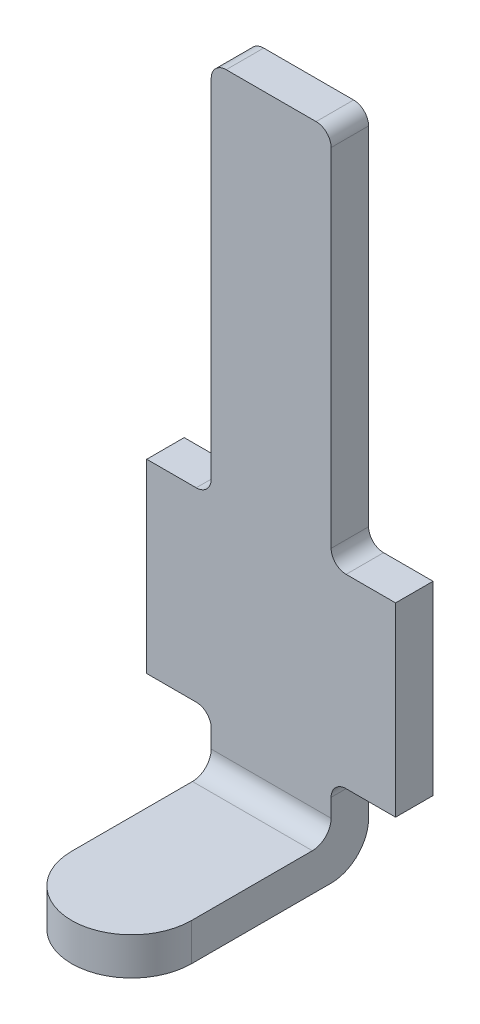
ISO-10303-21;
HEADER;
FILE_DESCRIPTION(('STEP AP214'),'2;1');
FILE_NAME('part.step','',(''),(''),'','','');
FILE_SCHEMA(('AUTOMOTIVE_DESIGN { 1 0 10303 214 1 1 1 1 }'));
ENDSEC;
DATA;
#1=APPLICATION_CONTEXT('core data for automotive mechanical design processes');
#2=APPLICATION_PROTOCOL_DEFINITION('international standard','automotive_design',2000,#1);
#3=PRODUCT_CONTEXT('',#1,'mechanical');
#4=PRODUCT('Part','Part','',(#3));
#5=PRODUCT_RELATED_PRODUCT_CATEGORY('part','',(#4));
#6=PRODUCT_DEFINITION_FORMATION('','',#4);
#7=PRODUCT_DEFINITION_CONTEXT('part definition',#1,'design');
#8=PRODUCT_DEFINITION('design','',#6,#7);
#9=PRODUCT_DEFINITION_SHAPE('','',#8);
#10=(LENGTH_UNIT() NAMED_UNIT(*) SI_UNIT(.MILLI.,.METRE.));
#11=(NAMED_UNIT(*) PLANE_ANGLE_UNIT() SI_UNIT($,.RADIAN.));
#12=(NAMED_UNIT(*) SI_UNIT($,.STERADIAN.) SOLID_ANGLE_UNIT());
#13=UNCERTAINTY_MEASURE_WITH_UNIT(LENGTH_MEASURE(1.E-05),#10,'distance_accuracy_value','');
#14=(GEOMETRIC_REPRESENTATION_CONTEXT(3) GLOBAL_UNCERTAINTY_ASSIGNED_CONTEXT((#13)) GLOBAL_UNIT_ASSIGNED_CONTEXT((#10,
#11,#12)) REPRESENTATION_CONTEXT('',''));
#15=CARTESIAN_POINT('',(0.,0.,0.));
#16=DIRECTION('',(0.,0.,1.));
#17=DIRECTION('',(1.,0.,0.));
#18=AXIS2_PLACEMENT_3D('',#15,#16,#17);
#19=CARTESIAN_POINT('',(13.47,0.0459658151929143,0.749000000000012));
#20=DIRECTION('',(0.,0.,-1.));
#21=DIRECTION('',(-1.,0.,0.));
#22=AXIS2_PLACEMENT_3D('',#19,#20,#21);
#23=CYLINDRICAL_SURFACE('',#22,0.1);
#24=CARTESIAN_POINT('',(13.47,0.0459658151929143,0.498999999999983));
#25=DIRECTION('',(0.,0.,1.));
#26=DIRECTION('',(1.,0.,0.));
#27=AXIS2_PLACEMENT_3D('',#24,#25,#26);
#28=CIRCLE('',#27,0.1);
#29=CARTESIAN_POINT('',(13.57,0.0459658151929143,0.498999999999983));
#30=VERTEX_POINT('',#29);
#31=CARTESIAN_POINT('',(13.47,0.145965815192914,0.499000000000012));
#32=VERTEX_POINT('',#31);
#33=EDGE_CURVE('E190',#30,#32,#28,.T.);
#34=ORIENTED_EDGE('',*,*,#33,.F.);
#35=DIRECTION('',(0.,0.,-1.));
#36=VECTOR('',#35,1.);
#37=CARTESIAN_POINT('',(13.57,0.0459658151929143,0.499000000000012));
#38=LINE('',#37,#36);
#39=CARTESIAN_POINT('',(13.57,0.0459658151929143,0.748999999999983));
#40=VERTEX_POINT('',#39);
#41=EDGE_CURVE('E332',#40,#30,#38,.T.);
#42=ORIENTED_EDGE('',*,*,#41,.F.);
#43=CARTESIAN_POINT('',(13.47,0.0459658151929143,0.748999999999983));
#44=DIRECTION('',(0.,0.,-1.));
#45=DIRECTION('',(-1.,0.,0.));
#46=AXIS2_PLACEMENT_3D('',#43,#44,#45);
#47=CIRCLE('',#46,0.1);
#48=CARTESIAN_POINT('',(13.47,0.145965815192914,0.749000000000012));
#49=VERTEX_POINT('',#48);
#50=EDGE_CURVE('E193',#49,#40,#47,.T.);
#51=ORIENTED_EDGE('',*,*,#50,.F.);
#52=DIRECTION('',(0.,0.,1.));
#53=VECTOR('',#52,1.);
#54=CARTESIAN_POINT('',(13.47,0.145965815192914,0.748999999999983));
#55=LINE('',#54,#53);
#56=EDGE_CURVE('E186',#32,#49,#55,.T.);
#57=ORIENTED_EDGE('',*,*,#56,.F.);
#58=EDGE_LOOP('',(#34,#42,#51,#57));
#59=FACE_BOUND('',#58,.T.);
#60=ADVANCED_FACE('F16',(#59),#23,.F.);
#61=CARTESIAN_POINT('',(14.47,0.0459658151929143,0.748999999999984));
#62=DIRECTION('',(0.,0.,1.));
#63=DIRECTION('',(1.,0.,0.));
#64=AXIS2_PLACEMENT_3D('',#61,#62,#63);
#65=CYLINDRICAL_SURFACE('',#64,0.1);
#66=CARTESIAN_POINT('',(14.47,0.0459658151929143,0.498999999999984));
#67=DIRECTION('',(0.,0.,1.));
#68=DIRECTION('',(1.,0.,0.));
#69=AXIS2_PLACEMENT_3D('',#66,#67,#68);
#70=CIRCLE('',#69,0.1);
#71=CARTESIAN_POINT('',(14.47,0.145965815192914,0.499000000000013));
#72=VERTEX_POINT('',#71);
#73=CARTESIAN_POINT('',(14.37,0.0459658151929143,0.498999999999984));
#74=VERTEX_POINT('',#73);
#75=EDGE_CURVE('E310',#72,#74,#70,.T.);
#76=ORIENTED_EDGE('',*,*,#75,.F.);
#77=DIRECTION('',(0.,0.,-1.));
#78=VECTOR('',#77,1.);
#79=CARTESIAN_POINT('',(14.47,0.145965815192914,0.749000000000013));
#80=LINE('',#79,#78);
#81=CARTESIAN_POINT('',(14.47,0.145965815192914,0.749000000000013));
#82=VERTEX_POINT('',#81);
#83=EDGE_CURVE('E27',#82,#72,#80,.T.);
#84=ORIENTED_EDGE('',*,*,#83,.F.);
#85=CARTESIAN_POINT('',(14.47,0.0459658151929143,0.748999999999984));
#86=DIRECTION('',(0.,0.,-1.));
#87=DIRECTION('',(-1.,0.,0.));
#88=AXIS2_PLACEMENT_3D('',#85,#86,#87);
#89=CIRCLE('',#88,0.1);
#90=CARTESIAN_POINT('',(14.37,0.0459658151929143,0.748999999999984));
#91=VERTEX_POINT('',#90);
#92=EDGE_CURVE('E381',#91,#82,#89,.T.);
#93=ORIENTED_EDGE('',*,*,#92,.F.);
#94=DIRECTION('',(0.,0.,1.));
#95=VECTOR('',#94,1.);
#96=CARTESIAN_POINT('',(14.37,0.0459658151929143,0.748999999999984));
#97=LINE('',#96,#95);
#98=EDGE_CURVE('E348',#74,#91,#97,.T.);
#99=ORIENTED_EDGE('',*,*,#98,.F.);
#100=EDGE_LOOP('',(#76,#84,#93,#99));
#101=FACE_BOUND('',#100,.T.);
#102=ADVANCED_FACE('F716',(#101),#65,.F.);
#103=CARTESIAN_POINT('',(13.47,1.48437551370885,0.748999999999983));
#104=DIRECTION('',(0.,0.,1.));
#105=DIRECTION('',(1.,0.,0.));
#106=AXIS2_PLACEMENT_3D('',#103,#104,#105);
#107=CYLINDRICAL_SURFACE('',#106,0.1);
#108=CARTESIAN_POINT('',(13.47,1.48437551370885,0.498999999999983));
#109=DIRECTION('',(0.,0.,1.));
#110=DIRECTION('',(1.,0.,0.));
#111=AXIS2_PLACEMENT_3D('',#108,#109,#110);
#112=CIRCLE('',#111,0.1);
#113=CARTESIAN_POINT('',(13.47,1.38437551370885,0.499000000000012));
#114=VERTEX_POINT('',#113);
#115=CARTESIAN_POINT('',(13.57,1.48437551370885,0.498999999999983));
#116=VERTEX_POINT('',#115);
#117=EDGE_CURVE('E299',#114,#116,#112,.T.);
#118=ORIENTED_EDGE('',*,*,#117,.F.);
#119=DIRECTION('',(0.,0.,-1.));
#120=VECTOR('',#119,1.);
#121=CARTESIAN_POINT('',(13.47,1.38437551370885,0.749000000000012));
#122=LINE('',#121,#120);
#123=CARTESIAN_POINT('',(13.47,1.38437551370885,0.749000000000012));
#124=VERTEX_POINT('',#123);
#125=EDGE_CURVE('E42',#124,#114,#122,.T.);
#126=ORIENTED_EDGE('',*,*,#125,.F.);
#127=CARTESIAN_POINT('',(13.47,1.48437551370885,0.748999999999983));
#128=DIRECTION('',(0.,0.,-1.));
#129=DIRECTION('',(-1.,0.,0.));
#130=AXIS2_PLACEMENT_3D('',#127,#128,#129);
#131=CIRCLE('',#130,0.1);
#132=CARTESIAN_POINT('',(13.57,1.48437551370885,0.748999999999983));
#133=VERTEX_POINT('',#132);
#134=EDGE_CURVE('E289',#133,#124,#131,.T.);
#135=ORIENTED_EDGE('',*,*,#134,.F.);
#136=DIRECTION('',(0.,0.,1.));
#137=VECTOR('',#136,1.);
#138=CARTESIAN_POINT('',(13.57,1.48437551370885,0.748999999999983));
#139=LINE('',#138,#137);
#140=EDGE_CURVE('E246',#116,#133,#139,.T.);
#141=ORIENTED_EDGE('',*,*,#140,.F.);
#142=EDGE_LOOP('',(#118,#126,#135,#141));
#143=FACE_BOUND('',#142,.T.);
#144=ADVANCED_FACE('F635',(#143),#107,.F.);
#145=CARTESIAN_POINT('',(14.47,1.48437551370885,0.749000000000014));
#146=DIRECTION('',(0.,0.,-1.));
#147=DIRECTION('',(-1.,0.,0.));
#148=AXIS2_PLACEMENT_3D('',#145,#146,#147);
#149=CYLINDRICAL_SURFACE('',#148,0.1);
#150=CARTESIAN_POINT('',(14.47,1.48437551370885,0.498999999999985));
#151=DIRECTION('',(0.,0.,1.));
#152=DIRECTION('',(1.,0.,0.));
#153=AXIS2_PLACEMENT_3D('',#150,#151,#152);
#154=CIRCLE('',#153,0.1);
#155=CARTESIAN_POINT('',(14.37,1.48437551370885,0.498999999999984));
#156=VERTEX_POINT('',#155);
#157=CARTESIAN_POINT('',(14.47,1.38437551370885,0.499000000000013));
#158=VERTEX_POINT('',#157);
#159=EDGE_CURVE('E262',#156,#158,#154,.T.);
#160=ORIENTED_EDGE('',*,*,#159,.F.);
#161=DIRECTION('',(0.,0.,-1.));
#162=VECTOR('',#161,1.);
#163=CARTESIAN_POINT('',(14.37,1.48437551370885,0.498999999999984));
#164=LINE('',#163,#162);
#165=CARTESIAN_POINT('',(14.37,1.48437551370885,0.748999999999984));
#166=VERTEX_POINT('',#165);
#167=EDGE_CURVE('E226',#166,#156,#164,.T.);
#168=ORIENTED_EDGE('',*,*,#167,.F.);
#169=CARTESIAN_POINT('',(14.47,1.48437551370885,0.748999999999984));
#170=DIRECTION('',(0.,0.,-1.));
#171=DIRECTION('',(-1.,0.,0.));
#172=AXIS2_PLACEMENT_3D('',#169,#170,#171);
#173=CIRCLE('',#172,0.1);
#174=CARTESIAN_POINT('',(14.47,1.38437551370885,0.749000000000014));
#175=VERTEX_POINT('',#174);
#176=EDGE_CURVE('E340',#175,#166,#173,.T.);
#177=ORIENTED_EDGE('',*,*,#176,.F.);
#178=DIRECTION('',(0.,0.,1.));
#179=VECTOR('',#178,1.);
#180=CARTESIAN_POINT('',(14.47,1.38437551370885,0.748999999999984));
#181=LINE('',#180,#179);
#182=EDGE_CURVE('E88',#158,#175,#181,.T.);
#183=ORIENTED_EDGE('',*,*,#182,.F.);
#184=EDGE_LOOP('',(#160,#168,#177,#183));
#185=FACE_BOUND('',#184,.T.);
#186=ADVANCED_FACE('F608',(#185),#149,.F.);
#187=CARTESIAN_POINT('',(13.67,3.8,0.748999999999983));
#188=DIRECTION('',(0.,0.,-1.));
#189=DIRECTION('',(-1.,0.,0.));
#190=AXIS2_PLACEMENT_3D('',#187,#188,#189);
#191=CYLINDRICAL_SURFACE('',#190,0.1);
#192=CARTESIAN_POINT('',(13.67,3.8,0.498999999999984));
#193=DIRECTION('',(0.,0.,-1.));
#194=DIRECTION('',(1.,0.,0.));
#195=AXIS2_PLACEMENT_3D('',#192,#193,#194);
#196=CIRCLE('',#195,0.1);
#197=CARTESIAN_POINT('',(13.57,3.8,0.498999999999984));
#198=VERTEX_POINT('',#197);
#199=CARTESIAN_POINT('',(13.67,3.9,0.498999999999984));
#200=VERTEX_POINT('',#199);
#201=EDGE_CURVE('E302',#198,#200,#196,.T.);
#202=ORIENTED_EDGE('',*,*,#201,.F.);
#203=DIRECTION('',(0.,0.,-1.));
#204=VECTOR('',#203,1.);
#205=CARTESIAN_POINT('',(13.57,3.8,0.498999999999984));
#206=LINE('',#205,#204);
#207=CARTESIAN_POINT('',(13.57,3.8,0.748999999999983));
#208=VERTEX_POINT('',#207);
#209=EDGE_CURVE('E225',#208,#198,#206,.T.);
#210=ORIENTED_EDGE('',*,*,#209,.F.);
#211=CARTESIAN_POINT('',(13.67,3.8,0.748999999999983));
#212=DIRECTION('',(0.,0.,1.));
#213=DIRECTION('',(-1.,0.,0.));
#214=AXIS2_PLACEMENT_3D('',#211,#212,#213);
#215=CIRCLE('',#214,0.1);
#216=CARTESIAN_POINT('',(13.67,3.9,0.748999999999983));
#217=VERTEX_POINT('',#216);
#218=EDGE_CURVE('E285',#217,#208,#215,.T.);
#219=ORIENTED_EDGE('',*,*,#218,.F.);
#220=DIRECTION('',(0.,0.,1.));
#221=VECTOR('',#220,1.);
#222=CARTESIAN_POINT('',(13.67,3.9,0.748999999999983));
#223=LINE('',#222,#221);
#224=EDGE_CURVE('E251',#200,#217,#223,.T.);
#225=ORIENTED_EDGE('',*,*,#224,.F.);
#226=EDGE_LOOP('',(#202,#210,#219,#225));
#227=FACE_BOUND('',#226,.T.);
#228=ADVANCED_FACE('F639',(#227),#191,.T.);
#229=CARTESIAN_POINT('',(14.27,3.8,0.748999999999984));
#230=DIRECTION('',(0.,0.,1.));
#231=DIRECTION('',(1.,0.,0.));
#232=AXIS2_PLACEMENT_3D('',#229,#230,#231);
#233=CYLINDRICAL_SURFACE('',#232,0.1);
#234=CARTESIAN_POINT('',(14.27,3.8,0.498999999999985));
#235=DIRECTION('',(0.,0.,-1.));
#236=DIRECTION('',(1.,0.,0.));
#237=AXIS2_PLACEMENT_3D('',#234,#235,#236);
#238=CIRCLE('',#237,0.1);
#239=CARTESIAN_POINT('',(14.27,3.9,0.498999999999985));
#240=VERTEX_POINT('',#239);
#241=CARTESIAN_POINT('',(14.37,3.8,0.498999999999985));
#242=VERTEX_POINT('',#241);
#243=EDGE_CURVE('E373',#240,#242,#238,.T.);
#244=ORIENTED_EDGE('',*,*,#243,.F.);
#245=DIRECTION('',(0.,0.,-1.));
#246=VECTOR('',#245,1.);
#247=CARTESIAN_POINT('',(14.27,3.9,0.748999999999984));
#248=LINE('',#247,#246);
#249=CARTESIAN_POINT('',(14.27,3.9,0.748999999999984));
#250=VERTEX_POINT('',#249);
#251=EDGE_CURVE('E252',#250,#240,#248,.T.);
#252=ORIENTED_EDGE('',*,*,#251,.F.);
#253=CARTESIAN_POINT('',(14.27,3.8,0.748999999999984));
#254=DIRECTION('',(0.,0.,1.));
#255=DIRECTION('',(-1.,0.,0.));
#256=AXIS2_PLACEMENT_3D('',#253,#254,#255);
#257=CIRCLE('',#256,0.1);
#258=CARTESIAN_POINT('',(14.37,3.8,0.748999999999984));
#259=VERTEX_POINT('',#258);
#260=EDGE_CURVE('E266',#259,#250,#257,.T.);
#261=ORIENTED_EDGE('',*,*,#260,.F.);
#262=DIRECTION('',(0.,0.,1.));
#263=VECTOR('',#262,1.);
#264=CARTESIAN_POINT('',(14.37,3.8,0.748999999999984));
#265=LINE('',#264,#263);
#266=EDGE_CURVE('E238',#242,#259,#265,.T.);
#267=ORIENTED_EDGE('',*,*,#266,.F.);
#268=EDGE_LOOP('',(#244,#252,#261,#267));
#269=FACE_BOUND('',#268,.T.);
#270=ADVANCED_FACE('F615',(#269),#233,.T.);
#271=CARTESIAN_POINT('',(14.8,0.,1.00308650274883E-13));
#272=DIRECTION('',(-1.,0.,0.));
#273=DIRECTION('',(0.,0.,1.));
#274=AXIS2_PLACEMENT_3D('',#271,#272,#273);
#275=PLANE('',#274);
#276=DIRECTION('',(0.,0.,-1.));
#277=VECTOR('',#276,1.);
#278=CARTESIAN_POINT('',(14.8,1.38437551370885,0.749000000000014));
#279=LINE('',#278,#277);
#280=CARTESIAN_POINT('',(14.8,1.38437551370885,0.749000000000014));
#281=VERTEX_POINT('',#280);
#282=CARTESIAN_POINT('',(14.8,1.38437551370885,0.499000000000014));
#283=VERTEX_POINT('',#282);
#284=EDGE_CURVE('E221',#281,#283,#279,.T.);
#285=ORIENTED_EDGE('',*,*,#284,.F.);
#286=DIRECTION('',(0.,-1.,0.));
#287=VECTOR('',#286,1.);
#288=CARTESIAN_POINT('',(14.8,1.38437551370885,0.749000000000014));
#289=LINE('',#288,#287);
#290=CARTESIAN_POINT('',(14.8,0.145965815192914,0.749000000000014));
#291=VERTEX_POINT('',#290);
#292=EDGE_CURVE('E366',#281,#291,#289,.T.);
#293=ORIENTED_EDGE('',*,*,#292,.T.);
#294=DIRECTION('',(0.,0.,-1.));
#295=VECTOR('',#294,1.);
#296=CARTESIAN_POINT('',(14.8,0.145965815192914,0.749000000000014));
#297=LINE('',#296,#295);
#298=CARTESIAN_POINT('',(14.8,0.145965815192914,0.499000000000014));
#299=VERTEX_POINT('',#298);
#300=EDGE_CURVE('E11',#291,#299,#297,.T.);
#301=ORIENTED_EDGE('',*,*,#300,.T.);
#302=DIRECTION('',(0.,-1.,0.));
#303=VECTOR('',#302,1.);
#304=CARTESIAN_POINT('',(14.8,1.38437551370885,0.499000000000014));
#305=LINE('',#304,#303);
#306=EDGE_CURVE('E261',#283,#299,#305,.T.);
#307=ORIENTED_EDGE('',*,*,#306,.F.);
#308=EDGE_LOOP('',(#285,#293,#301,#307));
#309=FACE_BOUND('',#308,.T.);
#310=ADVANCED_FACE('F477',(#309),#275,.F.);
#311=CARTESIAN_POINT('',(13.14,0.145965815192914,0.749000000000011));
#312=DIRECTION('',(0.,-1.,0.));
#313=DIRECTION('',(0.,0.,-1.));
#314=AXIS2_PLACEMENT_3D('',#311,#312,#313);
#315=PLANE('',#314);
#316=DIRECTION('',(1.,0.,0.));
#317=VECTOR('',#316,1.);
#318=CARTESIAN_POINT('',(13.14,0.145965815192914,0.749000000000011));
#319=LINE('',#318,#317);
#320=EDGE_CURVE('E20',#82,#291,#319,.T.);
#321=ORIENTED_EDGE('',*,*,#320,.F.);
#322=ORIENTED_EDGE('',*,*,#83,.T.);
#323=DIRECTION('',(1.,0.,0.));
#324=VECTOR('',#323,1.);
#325=CARTESIAN_POINT('',(13.14,0.145965815192914,0.499000000000011));
#326=LINE('',#325,#324);
#327=EDGE_CURVE('E280',#72,#299,#326,.T.);
#328=ORIENTED_EDGE('',*,*,#327,.T.);
#329=ORIENTED_EDGE('',*,*,#300,.F.);
#330=EDGE_LOOP('',(#321,#322,#328,#329));
#331=FACE_BOUND('',#330,.T.);
#332=ADVANCED_FACE('F470',(#331),#315,.T.);
#333=CARTESIAN_POINT('',(13.14,1.38437551370885,0.749000000000012));
#334=DIRECTION('',(0.,-1.,0.));
#335=DIRECTION('',(0.,0.,-1.));
#336=AXIS2_PLACEMENT_3D('',#333,#334,#335);
#337=PLANE('',#336);
#338=DIRECTION('',(1.,0.,0.));
#339=VECTOR('',#338,1.);
#340=CARTESIAN_POINT('',(13.14,1.38437551370885,0.499000000000011));
#341=LINE('',#340,#339);
#342=EDGE_CURVE('E257',#158,#283,#341,.T.);
#343=ORIENTED_EDGE('',*,*,#342,.F.);
#344=ORIENTED_EDGE('',*,*,#182,.T.);
#345=DIRECTION('',(1.,0.,0.));
#346=VECTOR('',#345,1.);
#347=CARTESIAN_POINT('',(13.14,1.38437551370885,0.749000000000012));
#348=LINE('',#347,#346);
#349=EDGE_CURVE('E344',#175,#281,#348,.T.);
#350=ORIENTED_EDGE('',*,*,#349,.T.);
#351=ORIENTED_EDGE('',*,*,#284,.T.);
#352=EDGE_LOOP('',(#343,#344,#350,#351));
#353=FACE_BOUND('',#352,.T.);
#354=ADVANCED_FACE('F606',(#353),#337,.F.);
#355=CARTESIAN_POINT('',(13.14,1.38437551370885,0.749000000000012));
#356=DIRECTION('',(0.,-1.,0.));
#357=DIRECTION('',(0.,0.,-1.));
#358=AXIS2_PLACEMENT_3D('',#355,#356,#357);
#359=PLANE('',#358);
#360=DIRECTION('',(1.,0.,0.));
#361=VECTOR('',#360,1.);
#362=CARTESIAN_POINT('',(13.14,1.38437551370885,0.749000000000012));
#363=LINE('',#362,#361);
#364=CARTESIAN_POINT('',(13.14,1.38437551370885,0.749000000000012));
#365=VERTEX_POINT('',#364);
#366=EDGE_CURVE('E233',#365,#124,#363,.T.);
#367=ORIENTED_EDGE('',*,*,#366,.T.);
#368=ORIENTED_EDGE('',*,*,#125,.T.);
#369=DIRECTION('',(1.,0.,0.));
#370=VECTOR('',#369,1.);
#371=CARTESIAN_POINT('',(13.14,1.38437551370885,0.499000000000011));
#372=LINE('',#371,#370);
#373=CARTESIAN_POINT('',(13.14,1.38437551370885,0.499000000000011));
#374=VERTEX_POINT('',#373);
#375=EDGE_CURVE('E303',#374,#114,#372,.T.);
#376=ORIENTED_EDGE('',*,*,#375,.F.);
#377=DIRECTION('',(0.,0.,-1.));
#378=VECTOR('',#377,1.);
#379=CARTESIAN_POINT('',(13.14,1.38437551370885,0.749000000000012));
#380=LINE('',#379,#378);
#381=EDGE_CURVE('E315',#365,#374,#380,.T.);
#382=ORIENTED_EDGE('',*,*,#381,.F.);
#383=EDGE_LOOP('',(#367,#368,#376,#382));
#384=FACE_BOUND('',#383,.T.);
#385=ADVANCED_FACE('F693',(#384),#359,.F.);
#386=CARTESIAN_POINT('',(13.14,0.145965815192914,0.749000000000011));
#387=DIRECTION('',(0.,-1.,0.));
#388=DIRECTION('',(0.,0.,-1.));
#389=AXIS2_PLACEMENT_3D('',#386,#387,#388);
#390=PLANE('',#389);
#391=DIRECTION('',(1.,0.,0.));
#392=VECTOR('',#391,1.);
#393=CARTESIAN_POINT('',(13.14,0.145965815192914,0.499000000000011));
#394=LINE('',#393,#392);
#395=CARTESIAN_POINT('',(13.14,0.145965815192914,0.499000000000011));
#396=VERTEX_POINT('',#395);
#397=EDGE_CURVE('E201',#396,#32,#394,.T.);
#398=ORIENTED_EDGE('',*,*,#397,.T.);
#399=ORIENTED_EDGE('',*,*,#56,.T.);
#400=DIRECTION('',(1.,0.,0.));
#401=VECTOR('',#400,1.);
#402=CARTESIAN_POINT('',(13.14,0.145965815192914,0.749000000000011));
#403=LINE('',#402,#401);
#404=CARTESIAN_POINT('',(13.14,0.145965815192914,0.749000000000011));
#405=VERTEX_POINT('',#404);
#406=EDGE_CURVE('E232',#405,#49,#403,.T.);
#407=ORIENTED_EDGE('',*,*,#406,.F.);
#408=DIRECTION('',(0.,0.,-1.));
#409=VECTOR('',#408,1.);
#410=CARTESIAN_POINT('',(13.14,0.145965815192914,0.749000000000011));
#411=LINE('',#410,#409);
#412=EDGE_CURVE('E198',#405,#396,#411,.T.);
#413=ORIENTED_EDGE('',*,*,#412,.T.);
#414=EDGE_LOOP('',(#398,#399,#407,#413));
#415=FACE_BOUND('',#414,.T.);
#416=ADVANCED_FACE('F202',(#415),#390,.T.);
#417=CARTESIAN_POINT('',(13.14,0.,0.));
#418=DIRECTION('',(-1.,0.,0.));
#419=DIRECTION('',(0.,0.,1.));
#420=AXIS2_PLACEMENT_3D('',#417,#418,#419);
#421=PLANE('',#420);
#422=ORIENTED_EDGE('',*,*,#381,.T.);
#423=DIRECTION('',(0.,-1.,0.));
#424=VECTOR('',#423,1.);
#425=CARTESIAN_POINT('',(13.14,1.38437551370885,0.499000000000011));
#426=LINE('',#425,#424);
#427=EDGE_CURVE('E206',#374,#396,#426,.T.);
#428=ORIENTED_EDGE('',*,*,#427,.T.);
#429=ORIENTED_EDGE('',*,*,#412,.F.);
#430=DIRECTION('',(0.,-1.,0.));
#431=VECTOR('',#430,1.);
#432=CARTESIAN_POINT('',(13.14,1.38437551370885,0.749000000000012));
#433=LINE('',#432,#431);
#434=EDGE_CURVE('E228',#365,#405,#433,.T.);
#435=ORIENTED_EDGE('',*,*,#434,.F.);
#436=EDGE_LOOP('',(#422,#428,#429,#435));
#437=FACE_BOUND('',#436,.T.);
#438=ADVANCED_FACE('F669',(#437),#421,.T.);
#439=CARTESIAN_POINT('',(13.97,-0.2,1.68));
#440=DIRECTION('',(0.,-1.,0.));
#441=DIRECTION('',(0.,0.,-1.));
#442=AXIS2_PLACEMENT_3D('',#439,#440,#441);
#443=CYLINDRICAL_SURFACE('',#442,0.4);
#444=DIRECTION('',(0.,-1.,0.));
#445=VECTOR('',#444,1.);
#446=CARTESIAN_POINT('',(14.37,-0.2,1.68));
#447=LINE('',#446,#445);
#448=CARTESIAN_POINT('',(14.37,-0.2,1.68));
#449=VERTEX_POINT('',#448);
#450=CARTESIAN_POINT('',(14.37,-0.45,1.68));
#451=VERTEX_POINT('',#450);
#452=EDGE_CURVE('E334',#449,#451,#447,.T.);
#453=ORIENTED_EDGE('',*,*,#452,.F.);
#454=CARTESIAN_POINT('',(13.97,-0.2,1.68));
#455=DIRECTION('',(0.,1.,0.));
#456=DIRECTION('',(0.,0.,-1.));
#457=AXIS2_PLACEMENT_3D('',#454,#455,#456);
#458=CIRCLE('',#457,0.4);
#459=CARTESIAN_POINT('',(13.57,-0.2,1.68));
#460=VERTEX_POINT('',#459);
#461=EDGE_CURVE('E318',#460,#449,#458,.T.);
#462=ORIENTED_EDGE('',*,*,#461,.F.);
#463=DIRECTION('',(0.,1.,0.));
#464=VECTOR('',#463,1.);
#465=CARTESIAN_POINT('',(13.57,-0.2,1.68));
#466=LINE('',#465,#464);
#467=CARTESIAN_POINT('',(13.57,-0.45,1.68));
#468=VERTEX_POINT('',#467);
#469=EDGE_CURVE('E149',#468,#460,#466,.T.);
#470=ORIENTED_EDGE('',*,*,#469,.F.);
#471=CARTESIAN_POINT('',(13.97,-0.45,1.68));
#472=DIRECTION('',(0.,-1.,0.));
#473=DIRECTION('',(0.,0.,1.));
#474=AXIS2_PLACEMENT_3D('',#471,#472,#473);
#475=CIRCLE('',#474,0.4);
#476=EDGE_CURVE('E336',#451,#468,#475,.T.);
#477=ORIENTED_EDGE('',*,*,#476,.F.);
#478=EDGE_LOOP('',(#453,#462,#470,#477));
#479=FACE_BOUND('',#478,.T.);
#480=ADVANCED_FACE('F427',(#479),#443,.T.);
#481=CARTESIAN_POINT('',(13.57,-0.2,0.748999999999983));
#482=DIRECTION('',(-1.,0.,0.));
#483=DIRECTION('',(0.,0.,1.));
#484=AXIS2_PLACEMENT_3D('',#481,#482,#483);
#485=PLANE('',#484);
#486=DIRECTION('',(0.,-1.,0.));
#487=VECTOR('',#486,1.);
#488=CARTESIAN_POINT('',(13.57,3.9,0.748999999999983));
#489=LINE('',#488,#487);
#490=CARTESIAN_POINT('',(13.57,-0.0749999999999988,0.748999999999983));
#491=VERTEX_POINT('',#490);
#492=EDGE_CURVE('E240',#40,#491,#489,.T.);
#493=ORIENTED_EDGE('',*,*,#492,.F.);
#494=ORIENTED_EDGE('',*,*,#41,.T.);
#495=DIRECTION('',(0.,1.,0.));
#496=VECTOR('',#495,1.);
#497=CARTESIAN_POINT('',(13.57,3.9,0.498999999999984));
#498=LINE('',#497,#496);
#499=CARTESIAN_POINT('',(13.57,-0.2,0.498999999999983));
#500=VERTEX_POINT('',#499);
#501=EDGE_CURVE('E210',#500,#30,#498,.T.);
#502=ORIENTED_EDGE('',*,*,#501,.F.);
#503=CARTESIAN_POINT('',(13.57,-0.2,0.748999999999983));
#504=DIRECTION('',(1.,0.,0.));
#505=DIRECTION('',(0.,0.,1.));
#506=AXIS2_PLACEMENT_3D('',#503,#504,#505);
#507=CIRCLE('',#506,0.25);
#508=CARTESIAN_POINT('',(13.57,-0.45,0.748999999999983));
#509=VERTEX_POINT('',#508);
#510=EDGE_CURVE('E132',#509,#500,#507,.T.);
#511=ORIENTED_EDGE('',*,*,#510,.F.);
#512=DIRECTION('',(0.,0.,-1.));
#513=VECTOR('',#512,1.);
#514=CARTESIAN_POINT('',(13.57,-0.45,0.748999999999983));
#515=LINE('',#514,#513);
#516=EDGE_CURVE('E331',#468,#509,#515,.T.);
#517=ORIENTED_EDGE('',*,*,#516,.F.);
#518=ORIENTED_EDGE('',*,*,#469,.T.);
#519=DIRECTION('',(0.,0.,1.));
#520=VECTOR('',#519,1.);
#521=CARTESIAN_POINT('',(13.57,-0.2,0.873999999999983));
#522=LINE('',#521,#520);
#523=CARTESIAN_POINT('',(13.57,-0.2,0.873999999999983));
#524=VERTEX_POINT('',#523);
#525=EDGE_CURVE('E275',#524,#460,#522,.T.);
#526=ORIENTED_EDGE('',*,*,#525,.F.);
#527=CARTESIAN_POINT('',(13.57,-0.0749999999999988,0.873999999999983));
#528=DIRECTION('',(-1.,0.,0.));
#529=DIRECTION('',(0.,0.,1.));
#530=AXIS2_PLACEMENT_3D('',#527,#528,#529);
#531=CIRCLE('',#530,0.125);
#532=EDGE_CURVE('E326',#491,#524,#531,.T.);
#533=ORIENTED_EDGE('',*,*,#532,.F.);
#534=EDGE_LOOP('',(#493,#494,#502,#511,#517,#518,#526,#533));
#535=FACE_BOUND('',#534,.T.);
#536=ADVANCED_FACE('F508',(#535),#485,.T.);
#537=CARTESIAN_POINT('',(14.37,-0.2,0.748999999999984));
#538=DIRECTION('',(-1.,0.,0.));
#539=DIRECTION('',(0.,0.,1.));
#540=AXIS2_PLACEMENT_3D('',#537,#538,#539);
#541=PLANE('',#540);
#542=DIRECTION('',(0.,1.,0.));
#543=VECTOR('',#542,1.);
#544=CARTESIAN_POINT('',(14.37,3.9,0.498999999999985));
#545=LINE('',#544,#543);
#546=CARTESIAN_POINT('',(14.37,-0.2,0.498999999999984));
#547=VERTEX_POINT('',#546);
#548=EDGE_CURVE('E105',#547,#74,#545,.T.);
#549=ORIENTED_EDGE('',*,*,#548,.T.);
#550=ORIENTED_EDGE('',*,*,#98,.T.);
#551=DIRECTION('',(0.,-1.,0.));
#552=VECTOR('',#551,1.);
#553=CARTESIAN_POINT('',(14.37,3.9,0.748999999999984));
#554=LINE('',#553,#552);
#555=CARTESIAN_POINT('',(14.37,-0.0749999999999988,0.748999999999984));
#556=VERTEX_POINT('',#555);
#557=EDGE_CURVE('E377',#91,#556,#554,.T.);
#558=ORIENTED_EDGE('',*,*,#557,.T.);
#559=CARTESIAN_POINT('',(14.37,-0.0749999999999988,0.873999999999984));
#560=DIRECTION('',(-1.,0.,0.));
#561=DIRECTION('',(0.,0.,1.));
#562=AXIS2_PLACEMENT_3D('',#559,#560,#561);
#563=CIRCLE('',#562,0.125);
#564=CARTESIAN_POINT('',(14.37,-0.2,0.873999999999984));
#565=VERTEX_POINT('',#564);
#566=EDGE_CURVE('E271',#556,#565,#563,.T.);
#567=ORIENTED_EDGE('',*,*,#566,.T.);
#568=DIRECTION('',(0.,0.,1.));
#569=VECTOR('',#568,1.);
#570=CARTESIAN_POINT('',(14.37,-0.2,0.873999999999984));
#571=LINE('',#570,#569);
#572=EDGE_CURVE('E322',#565,#449,#571,.T.);
#573=ORIENTED_EDGE('',*,*,#572,.T.);
#574=ORIENTED_EDGE('',*,*,#452,.T.);
#575=DIRECTION('',(0.,0.,-1.));
#576=VECTOR('',#575,1.);
#577=CARTESIAN_POINT('',(14.37,-0.45,0.748999999999984));
#578=LINE('',#577,#576);
#579=CARTESIAN_POINT('',(14.37,-0.45,0.748999999999984));
#580=VERTEX_POINT('',#579);
#581=EDGE_CURVE('E330',#451,#580,#578,.T.);
#582=ORIENTED_EDGE('',*,*,#581,.T.);
#583=CARTESIAN_POINT('',(14.37,-0.2,0.748999999999984));
#584=DIRECTION('',(1.,0.,0.));
#585=DIRECTION('',(0.,0.,1.));
#586=AXIS2_PLACEMENT_3D('',#583,#584,#585);
#587=CIRCLE('',#586,0.25);
#588=EDGE_CURVE('E256',#580,#547,#587,.T.);
#589=ORIENTED_EDGE('',*,*,#588,.T.);
#590=EDGE_LOOP('',(#549,#550,#558,#567,#573,#574,#582,#589));
#591=FACE_BOUND('',#590,.T.);
#592=ADVANCED_FACE('F416',(#591),#541,.F.);
#593=CARTESIAN_POINT('',(14.37,3.9,0.498999999999985));
#594=DIRECTION('',(0.,0.,1.));
#595=DIRECTION('',(1.,0.,0.));
#596=AXIS2_PLACEMENT_3D('',#593,#594,#595);
#597=PLANE('',#596);
#598=DIRECTION('',(-1.,0.,0.));
#599=VECTOR('',#598,1.);
#600=CARTESIAN_POINT('',(14.37,3.9,0.498999999999985));
#601=LINE('',#600,#599);
#602=EDGE_CURVE('E247',#240,#200,#601,.T.);
#603=ORIENTED_EDGE('',*,*,#602,.F.);
#604=ORIENTED_EDGE('',*,*,#243,.T.);
#605=DIRECTION('',(0.,1.,0.));
#606=VECTOR('',#605,1.);
#607=CARTESIAN_POINT('',(14.37,3.9,0.498999999999985));
#608=LINE('',#607,#606);
#609=EDGE_CURVE('E234',#156,#242,#608,.T.);
#610=ORIENTED_EDGE('',*,*,#609,.F.);
#611=ORIENTED_EDGE('',*,*,#159,.T.);
#612=ORIENTED_EDGE('',*,*,#342,.T.);
#613=ORIENTED_EDGE('',*,*,#306,.T.);
#614=ORIENTED_EDGE('',*,*,#327,.F.);
#615=ORIENTED_EDGE('',*,*,#75,.T.);
#616=ORIENTED_EDGE('',*,*,#548,.F.);
#617=DIRECTION('',(-1.,0.,0.));
#618=VECTOR('',#617,1.);
#619=CARTESIAN_POINT('',(14.37,-0.2,0.498999999999984));
#620=LINE('',#619,#618);
#621=EDGE_CURVE('E253',#547,#500,#620,.T.);
#622=ORIENTED_EDGE('',*,*,#621,.T.);
#623=ORIENTED_EDGE('',*,*,#501,.T.);
#624=ORIENTED_EDGE('',*,*,#33,.T.);
#625=ORIENTED_EDGE('',*,*,#397,.F.);
#626=ORIENTED_EDGE('',*,*,#427,.F.);
#627=ORIENTED_EDGE('',*,*,#375,.T.);
#628=ORIENTED_EDGE('',*,*,#117,.T.);
#629=DIRECTION('',(0.,1.,0.));
#630=VECTOR('',#629,1.);
#631=CARTESIAN_POINT('',(13.57,3.9,0.498999999999984));
#632=LINE('',#631,#630);
#633=EDGE_CURVE('E242',#116,#198,#632,.T.);
#634=ORIENTED_EDGE('',*,*,#633,.T.);
#635=ORIENTED_EDGE('',*,*,#201,.T.);
#636=EDGE_LOOP('',(#603,#604,#610,#611,#612,#613,#614,#615,#616,#622,#623,#624,#625,#626,#627,
#628,#634,#635));
#637=FACE_BOUND('',#636,.T.);
#638=ADVANCED_FACE('F209',(#637),#597,.F.);
#639=CARTESIAN_POINT('',(14.37,-0.2,0.748999999999984));
#640=DIRECTION('',(-1.,0.,0.));
#641=DIRECTION('',(0.,0.,1.));
#642=AXIS2_PLACEMENT_3D('',#639,#640,#641);
#643=CYLINDRICAL_SURFACE('',#642,0.25);
#644=ORIENTED_EDGE('',*,*,#510,.T.);
#645=ORIENTED_EDGE('',*,*,#621,.F.);
#646=ORIENTED_EDGE('',*,*,#588,.F.);
#647=DIRECTION('',(-1.,0.,0.));
#648=VECTOR('',#647,1.);
#649=CARTESIAN_POINT('',(14.37,-0.45,0.748999999999984));
#650=LINE('',#649,#648);
#651=EDGE_CURVE('E327',#580,#509,#650,.T.);
#652=ORIENTED_EDGE('',*,*,#651,.T.);
#653=EDGE_LOOP('',(#644,#645,#646,#652));
#654=FACE_BOUND('',#653,.T.);
#655=ADVANCED_FACE('F688',(#654),#643,.T.);
#656=CARTESIAN_POINT('',(14.37,-0.45,0.748999999999984));
#657=DIRECTION('',(0.,1.,0.));
#658=DIRECTION('',(0.,0.,-1.));
#659=AXIS2_PLACEMENT_3D('',#656,#657,#658);
#660=PLANE('',#659);
#661=ORIENTED_EDGE('',*,*,#476,.T.);
#662=ORIENTED_EDGE('',*,*,#516,.T.);
#663=ORIENTED_EDGE('',*,*,#651,.F.);
#664=ORIENTED_EDGE('',*,*,#581,.F.);
#665=EDGE_LOOP('',(#661,#662,#663,#664));
#666=FACE_BOUND('',#665,.T.);
#667=ADVANCED_FACE('F652',(#666),#660,.F.);
#668=CARTESIAN_POINT('',(14.37,-0.2,0.873999999999984));
#669=DIRECTION('',(0.,-1.,0.));
#670=DIRECTION('',(0.,0.,-1.));
#671=AXIS2_PLACEMENT_3D('',#668,#669,#670);
#672=PLANE('',#671);
#673=ORIENTED_EDGE('',*,*,#525,.T.);
#674=ORIENTED_EDGE('',*,*,#461,.T.);
#675=ORIENTED_EDGE('',*,*,#572,.F.);
#676=DIRECTION('',(-1.,0.,0.));
#677=VECTOR('',#676,1.);
#678=CARTESIAN_POINT('',(14.37,-0.2,0.873999999999984));
#679=LINE('',#678,#677);
#680=EDGE_CURVE('E276',#565,#524,#679,.T.);
#681=ORIENTED_EDGE('',*,*,#680,.T.);
#682=EDGE_LOOP('',(#673,#674,#675,#681));
#683=FACE_BOUND('',#682,.T.);
#684=ADVANCED_FACE('F18',(#683),#672,.F.);
#685=CARTESIAN_POINT('',(14.37,-0.0749999999999988,0.873999999999984));
#686=DIRECTION('',(-1.,0.,0.));
#687=DIRECTION('',(0.,0.,1.));
#688=AXIS2_PLACEMENT_3D('',#685,#686,#687);
#689=CYLINDRICAL_SURFACE('',#688,0.125);
#690=ORIENTED_EDGE('',*,*,#532,.T.);
#691=ORIENTED_EDGE('',*,*,#680,.F.);
#692=ORIENTED_EDGE('',*,*,#566,.F.);
#693=DIRECTION('',(-1.,0.,0.));
#694=VECTOR('',#693,1.);
#695=CARTESIAN_POINT('',(14.37,-0.0749999999999988,0.748999999999984));
#696=LINE('',#695,#694);
#697=EDGE_CURVE('E298',#556,#491,#696,.T.);
#698=ORIENTED_EDGE('',*,*,#697,.T.);
#699=EDGE_LOOP('',(#690,#691,#692,#698));
#700=FACE_BOUND('',#699,.T.);
#701=ADVANCED_FACE('F506',(#700),#689,.F.);
#702=CARTESIAN_POINT('',(14.37,3.9,0.748999999999984));
#703=DIRECTION('',(0.,0.,-1.));
#704=DIRECTION('',(0.,-1.,0.));
#705=AXIS2_PLACEMENT_3D('',#702,#703,#704);
#706=PLANE('',#705);
#707=DIRECTION('',(0.,-1.,0.));
#708=VECTOR('',#707,1.);
#709=CARTESIAN_POINT('',(14.37,3.9,0.748999999999984));
#710=LINE('',#709,#708);
#711=EDGE_CURVE('E270',#259,#166,#710,.T.);
#712=ORIENTED_EDGE('',*,*,#711,.F.);
#713=ORIENTED_EDGE('',*,*,#260,.T.);
#714=DIRECTION('',(-1.,0.,0.));
#715=VECTOR('',#714,1.);
#716=CARTESIAN_POINT('',(14.37,3.9,0.748999999999984));
#717=LINE('',#716,#715);
#718=EDGE_CURVE('E284',#250,#217,#717,.T.);
#719=ORIENTED_EDGE('',*,*,#718,.T.);
#720=ORIENTED_EDGE('',*,*,#218,.T.);
#721=DIRECTION('',(0.,-1.,0.));
#722=VECTOR('',#721,1.);
#723=CARTESIAN_POINT('',(13.57,3.9,0.748999999999983));
#724=LINE('',#723,#722);
#725=EDGE_CURVE('E223',#208,#133,#724,.T.);
#726=ORIENTED_EDGE('',*,*,#725,.T.);
#727=ORIENTED_EDGE('',*,*,#134,.T.);
#728=ORIENTED_EDGE('',*,*,#366,.F.);
#729=ORIENTED_EDGE('',*,*,#434,.T.);
#730=ORIENTED_EDGE('',*,*,#406,.T.);
#731=ORIENTED_EDGE('',*,*,#50,.T.);
#732=ORIENTED_EDGE('',*,*,#492,.T.);
#733=ORIENTED_EDGE('',*,*,#697,.F.);
#734=ORIENTED_EDGE('',*,*,#557,.F.);
#735=ORIENTED_EDGE('',*,*,#92,.T.);
#736=ORIENTED_EDGE('',*,*,#320,.T.);
#737=ORIENTED_EDGE('',*,*,#292,.F.);
#738=ORIENTED_EDGE('',*,*,#349,.F.);
#739=ORIENTED_EDGE('',*,*,#176,.T.);
#740=EDGE_LOOP('',(#712,#713,#719,#720,#726,#727,#728,#729,#730,#731,#732,#733,#734,#735,#736,
#737,#738,#739));
#741=FACE_BOUND('',#740,.T.);
#742=ADVANCED_FACE('F481',(#741),#706,.F.);
#743=CARTESIAN_POINT('',(14.37,3.9,0.748999999999984));
#744=DIRECTION('',(0.,-1.,0.));
#745=DIRECTION('',(0.,0.,-1.));
#746=AXIS2_PLACEMENT_3D('',#743,#744,#745);
#747=PLANE('',#746);
#748=ORIENTED_EDGE('',*,*,#718,.F.);
#749=ORIENTED_EDGE('',*,*,#251,.T.);
#750=ORIENTED_EDGE('',*,*,#602,.T.);
#751=ORIENTED_EDGE('',*,*,#224,.T.);
#752=EDGE_LOOP('',(#748,#749,#750,#751));
#753=FACE_BOUND('',#752,.T.);
#754=ADVANCED_FACE('F618',(#753),#747,.F.);
#755=CARTESIAN_POINT('',(13.57,-0.2,0.748999999999983));
#756=DIRECTION('',(-1.,0.,0.));
#757=DIRECTION('',(0.,0.,1.));
#758=AXIS2_PLACEMENT_3D('',#755,#756,#757);
#759=PLANE('',#758);
#760=ORIENTED_EDGE('',*,*,#725,.F.);
#761=ORIENTED_EDGE('',*,*,#209,.T.);
#762=ORIENTED_EDGE('',*,*,#633,.F.);
#763=ORIENTED_EDGE('',*,*,#140,.T.);
#764=EDGE_LOOP('',(#760,#761,#762,#763));
#765=FACE_BOUND('',#764,.T.);
#766=ADVANCED_FACE('F638',(#765),#759,.T.);
#767=CARTESIAN_POINT('',(14.37,-0.2,0.748999999999984));
#768=DIRECTION('',(-1.,0.,0.));
#769=DIRECTION('',(0.,0.,1.));
#770=AXIS2_PLACEMENT_3D('',#767,#768,#769);
#771=PLANE('',#770);
#772=ORIENTED_EDGE('',*,*,#609,.T.);
#773=ORIENTED_EDGE('',*,*,#266,.T.);
#774=ORIENTED_EDGE('',*,*,#711,.T.);
#775=ORIENTED_EDGE('',*,*,#167,.T.);
#776=EDGE_LOOP('',(#772,#773,#774,#775));
#777=FACE_BOUND('',#776,.T.);
#778=ADVANCED_FACE('F612',(#777),#771,.F.);
#779=CLOSED_SHELL('',(#60,#102,#144,#186,#228,#270,#310,#332,#354,#385,#416,#438,#480,#536,#592,
#638,#655,#667,#684,#701,#742,#754,#766,#778));
#780=MANIFOLD_SOLID_BREP('B1',#779);
#781=ADVANCED_BREP_SHAPE_REPRESENTATION('',(#18,#780),#14);
#782=SHAPE_DEFINITION_REPRESENTATION(#9,#781);
ENDSEC;
END-ISO-10303-21;
